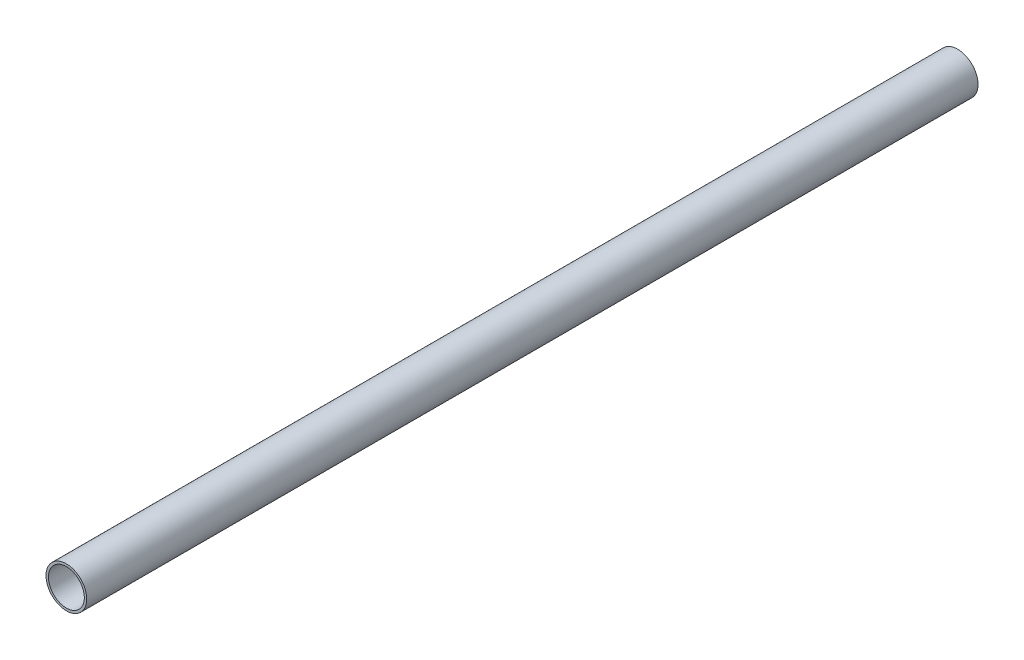
ISO-10303-21;
HEADER;
FILE_DESCRIPTION(('STEP AP214'),'2;1');
FILE_NAME('part.step','',(''),(''),'','','');
FILE_SCHEMA(('AUTOMOTIVE_DESIGN { 1 0 10303 214 1 1 1 1 }'));
ENDSEC;
DATA;
#1=APPLICATION_CONTEXT('core data for automotive mechanical design processes');
#2=APPLICATION_PROTOCOL_DEFINITION('international standard','automotive_design',2000,#1);
#3=PRODUCT_CONTEXT('',#1,'mechanical');
#4=PRODUCT('Part','Part','',(#3));
#5=PRODUCT_RELATED_PRODUCT_CATEGORY('part','',(#4));
#6=PRODUCT_DEFINITION_FORMATION('','',#4);
#7=PRODUCT_DEFINITION_CONTEXT('part definition',#1,'design');
#8=PRODUCT_DEFINITION('design','',#6,#7);
#9=PRODUCT_DEFINITION_SHAPE('','',#8);
#10=(LENGTH_UNIT() NAMED_UNIT(*) SI_UNIT(.MILLI.,.METRE.));
#11=(NAMED_UNIT(*) PLANE_ANGLE_UNIT() SI_UNIT($,.RADIAN.));
#12=(NAMED_UNIT(*) SI_UNIT($,.STERADIAN.) SOLID_ANGLE_UNIT());
#13=UNCERTAINTY_MEASURE_WITH_UNIT(LENGTH_MEASURE(1.E-05),#10,'distance_accuracy_value','');
#14=(GEOMETRIC_REPRESENTATION_CONTEXT(3) GLOBAL_UNCERTAINTY_ASSIGNED_CONTEXT((#13)) GLOBAL_UNIT_ASSIGNED_CONTEXT((#10,
#11,#12)) REPRESENTATION_CONTEXT('',''));
#15=CARTESIAN_POINT('',(0.,0.,0.));
#16=DIRECTION('',(0.,0.,1.));
#17=DIRECTION('',(1.,0.,0.));
#18=AXIS2_PLACEMENT_3D('',#15,#16,#17);
#19=CARTESIAN_POINT('',(0.,0.,372.));
#20=DIRECTION('',(0.,0.,-1.));
#21=DIRECTION('',(-1.,0.,0.));
#22=AXIS2_PLACEMENT_3D('',#19,#20,#21);
#23=CYLINDRICAL_SURFACE('',#22,17.);
#24=CARTESIAN_POINT('',(0.,0.,372.));
#25=DIRECTION('',(0.,0.,1.));
#26=DIRECTION('',(1.,0.,0.));
#27=AXIS2_PLACEMENT_3D('',#24,#25,#26);
#28=CIRCLE('',#27,17.);
#29=CARTESIAN_POINT('',(-17.,0.,372.));
#30=VERTEX_POINT('',#29);
#31=EDGE_CURVE('E10',#30,#30,#28,.T.);
#32=CARTESIAN_POINT('',(0.,0.,-372.));
#33=DIRECTION('',(0.,0.,1.));
#34=DIRECTION('',(1.,0.,0.));
#35=AXIS2_PLACEMENT_3D('',#32,#33,#34);
#36=CIRCLE('',#35,17.);
#37=CARTESIAN_POINT('',(-17.,0.,-372.));
#38=VERTEX_POINT('',#37);
#39=EDGE_CURVE('E33',#38,#38,#36,.T.);
#40=CARTESIAN_POINT('',(-17.,0.,372.));
#41=CARTESIAN_POINT('',(-17.,0.,364.25));
#42=CARTESIAN_POINT('',(-17.,0.,356.5));
#43=CARTESIAN_POINT('',(-17.,0.,341.));
#44=CARTESIAN_POINT('',(-17.,0.,333.25));
#45=CARTESIAN_POINT('',(-17.,0.,317.75));
#46=CARTESIAN_POINT('',(-17.,0.,310.));
#47=CARTESIAN_POINT('',(-17.,0.,294.5));
#48=CARTESIAN_POINT('',(-17.,0.,286.75));
#49=CARTESIAN_POINT('',(-17.,0.,271.25));
#50=CARTESIAN_POINT('',(-17.,0.,263.5));
#51=CARTESIAN_POINT('',(-17.,0.,248.));
#52=CARTESIAN_POINT('',(-17.,0.,240.25));
#53=CARTESIAN_POINT('',(-17.,0.,224.75));
#54=CARTESIAN_POINT('',(-17.,0.,217.));
#55=CARTESIAN_POINT('',(-17.,0.,201.5));
#56=CARTESIAN_POINT('',(-17.,0.,193.75));
#57=CARTESIAN_POINT('',(-17.,0.,178.25));
#58=CARTESIAN_POINT('',(-17.,0.,170.5));
#59=CARTESIAN_POINT('',(-17.,0.,155.));
#60=CARTESIAN_POINT('',(-17.,0.,147.25));
#61=CARTESIAN_POINT('',(-17.,0.,131.75));
#62=CARTESIAN_POINT('',(-17.,0.,124.));
#63=CARTESIAN_POINT('',(-17.,0.,108.5));
#64=CARTESIAN_POINT('',(-17.,0.,100.75));
#65=CARTESIAN_POINT('',(-17.,0.,85.25));
#66=CARTESIAN_POINT('',(-17.,0.,77.5));
#67=CARTESIAN_POINT('',(-17.,0.,62.));
#68=CARTESIAN_POINT('',(-17.,0.,54.25));
#69=CARTESIAN_POINT('',(-17.,0.,38.7499999999999));
#70=CARTESIAN_POINT('',(-17.,0.,30.9999999999999));
#71=CARTESIAN_POINT('',(-17.,0.,15.4999999999999));
#72=CARTESIAN_POINT('',(-17.,0.,7.74999999999994));
#73=CARTESIAN_POINT('',(-17.,0.,-7.75000000000005));
#74=CARTESIAN_POINT('',(-17.,0.,-15.5000000000001));
#75=CARTESIAN_POINT('',(-17.,0.,-31.));
#76=CARTESIAN_POINT('',(-17.,0.,-38.75));
#77=CARTESIAN_POINT('',(-17.,0.,-54.2500000000001));
#78=CARTESIAN_POINT('',(-17.,0.,-62.0000000000001));
#79=CARTESIAN_POINT('',(-17.,0.,-77.5000000000001));
#80=CARTESIAN_POINT('',(-17.,0.,-85.2500000000001));
#81=CARTESIAN_POINT('',(-17.,0.,-100.75));
#82=CARTESIAN_POINT('',(-17.,0.,-108.5));
#83=CARTESIAN_POINT('',(-17.,0.,-124.));
#84=CARTESIAN_POINT('',(-17.,0.,-131.75));
#85=CARTESIAN_POINT('',(-17.,0.,-147.25));
#86=CARTESIAN_POINT('',(-17.,0.,-155.));
#87=CARTESIAN_POINT('',(-17.,0.,-170.5));
#88=CARTESIAN_POINT('',(-17.,0.,-178.25));
#89=CARTESIAN_POINT('',(-17.,0.,-193.75));
#90=CARTESIAN_POINT('',(-17.,0.,-201.5));
#91=CARTESIAN_POINT('',(-17.,0.,-217.));
#92=CARTESIAN_POINT('',(-17.,0.,-224.75));
#93=CARTESIAN_POINT('',(-17.,0.,-240.25));
#94=CARTESIAN_POINT('',(-17.,0.,-248.));
#95=CARTESIAN_POINT('',(-17.,0.,-263.5));
#96=CARTESIAN_POINT('',(-17.,0.,-271.25));
#97=CARTESIAN_POINT('',(-17.,0.,-286.75));
#98=CARTESIAN_POINT('',(-17.,0.,-294.5));
#99=CARTESIAN_POINT('',(-17.,0.,-310.));
#100=CARTESIAN_POINT('',(-17.,0.,-317.75));
#101=CARTESIAN_POINT('',(-17.,0.,-333.25));
#102=CARTESIAN_POINT('',(-17.,0.,-341.));
#103=CARTESIAN_POINT('',(-17.,0.,-356.5));
#104=CARTESIAN_POINT('',(-17.,0.,-364.25));
#105=CARTESIAN_POINT('',(-17.,0.,-372.));
#106=B_SPLINE_CURVE_WITH_KNOTS('',3,(#40,#41,#42,#43,#44,#45,#46,#47,#48,#49,#50,#51,#52,#53,
#54,#55,#56,#57,#58,#59,#60,#61,#62,#63,#64,#65,#66,#67,#68,#69,#70,#71,#72,#73,#74,#75,#76,#77,
#78,#79,#80,#81,#82,#83,#84,#85,#86,#87,#88,#89,#90,#91,#92,#93,#94,#95,#96,#97,#98,#99,#100,
#101,#102,#103,#104,#105),.UNSPECIFIED.,.F.,.F.,(4,2,2,2,2,2,2,2,2,2,2,2,2,2,2,2,2,2,2,2,2,2,2,
2,2,2,2,2,2,2,2,2,4),(0.,23.25,46.5,69.75,93.,116.25,139.5,162.75,186.,209.25,232.5,255.75,279.,
302.25,325.5,348.75,372.,395.25,418.5,441.75,465.,488.25,511.5,534.75,558.,581.25,604.5,627.75,
651.,674.25,697.5,720.75,744.),.UNSPECIFIED.);
#107=EDGE_CURVE('BSEAM30',#30,#38,#106,.T.);
#108=ORIENTED_EDGE('',*,*,#31,.F.);
#109=ORIENTED_EDGE('',*,*,#39,.T.);
#110=ORIENTED_EDGE('',*,*,#107,.T.);
#111=ORIENTED_EDGE('',*,*,#107,.F.);
#112=EDGE_LOOP('',(#108,#110,#109,#111));
#113=FACE_BOUND('',#112,.T.);
#114=ADVANCED_FACE('F30',(#113),#23,.T.);
#115=CARTESIAN_POINT('',(0.,0.,372.));
#116=DIRECTION('',(0.,0.,1.));
#117=DIRECTION('',(1.,0.,0.));
#118=AXIS2_PLACEMENT_3D('',#115,#116,#117);
#119=PLANE('',#118);
#120=CARTESIAN_POINT('',(0.,0.,372.));
#121=DIRECTION('',(0.,0.,1.));
#122=DIRECTION('',(1.,0.,0.));
#123=AXIS2_PLACEMENT_3D('',#120,#121,#122);
#124=CIRCLE('',#123,15.);
#125=CARTESIAN_POINT('',(-15.,0.,372.));
#126=VERTEX_POINT('',#125);
#127=EDGE_CURVE('E40',#126,#126,#124,.T.);
#128=ORIENTED_EDGE('',*,*,#127,.F.);
#129=EDGE_LOOP('',(#128));
#130=FACE_BOUND('',#129,.T.);
#131=ORIENTED_EDGE('',*,*,#31,.T.);
#132=EDGE_LOOP('',(#131));
#133=FACE_BOUND('',#132,.T.);
#134=ADVANCED_FACE('F60',(#130,#133),#119,.T.);
#135=CARTESIAN_POINT('',(0.,0.,-372.));
#136=DIRECTION('',(0.,0.,1.));
#137=DIRECTION('',(1.,0.,0.));
#138=AXIS2_PLACEMENT_3D('',#135,#136,#137);
#139=PLANE('',#138);
#140=ORIENTED_EDGE('',*,*,#39,.F.);
#141=EDGE_LOOP('',(#140));
#142=FACE_BOUND('',#141,.T.);
#143=ADVANCED_FACE('F52',(#142),#139,.F.);
#144=CARTESIAN_POINT('',(0.,0.,372.));
#145=DIRECTION('',(0.,0.,-1.));
#146=DIRECTION('',(-1.,0.,0.));
#147=AXIS2_PLACEMENT_3D('',#144,#145,#146);
#148=CYLINDRICAL_SURFACE('',#147,15.);
#149=CARTESIAN_POINT('',(0.,0.,-370.));
#150=DIRECTION('',(0.,0.,1.));
#151=DIRECTION('',(1.,0.,0.));
#152=AXIS2_PLACEMENT_3D('',#149,#150,#151);
#153=CIRCLE('',#152,15.);
#154=CARTESIAN_POINT('',(-15.,0.,-370.));
#155=VERTEX_POINT('',#154);
#156=EDGE_CURVE('E44',#155,#155,#153,.T.);
#157=CARTESIAN_POINT('',(-15.,0.,372.));
#158=CARTESIAN_POINT('',(-15.,0.,364.270833333333));
#159=CARTESIAN_POINT('',(-15.,0.,356.541666666667));
#160=CARTESIAN_POINT('',(-15.,0.,341.083333333333));
#161=CARTESIAN_POINT('',(-15.,0.,333.354166666667));
#162=CARTESIAN_POINT('',(-15.,0.,317.895833333333));
#163=CARTESIAN_POINT('',(-15.,0.,310.166666666667));
#164=CARTESIAN_POINT('',(-15.,0.,294.708333333333));
#165=CARTESIAN_POINT('',(-15.,0.,286.979166666667));
#166=CARTESIAN_POINT('',(-15.,0.,271.520833333333));
#167=CARTESIAN_POINT('',(-15.,0.,263.791666666667));
#168=CARTESIAN_POINT('',(-15.,0.,248.333333333333));
#169=CARTESIAN_POINT('',(-15.,0.,240.604166666667));
#170=CARTESIAN_POINT('',(-15.,0.,225.145833333333));
#171=CARTESIAN_POINT('',(-15.,0.,217.416666666667));
#172=CARTESIAN_POINT('',(-15.,0.,201.958333333333));
#173=CARTESIAN_POINT('',(-15.,0.,194.229166666667));
#174=CARTESIAN_POINT('',(-15.,0.,178.770833333333));
#175=CARTESIAN_POINT('',(-15.,0.,171.041666666667));
#176=CARTESIAN_POINT('',(-15.,0.,155.583333333333));
#177=CARTESIAN_POINT('',(-15.,0.,147.854166666667));
#178=CARTESIAN_POINT('',(-15.,0.,132.395833333333));
#179=CARTESIAN_POINT('',(-15.,0.,124.666666666667));
#180=CARTESIAN_POINT('',(-15.,0.,109.208333333333));
#181=CARTESIAN_POINT('',(-15.,0.,101.479166666667));
#182=CARTESIAN_POINT('',(-15.,0.,86.0208333333333));
#183=CARTESIAN_POINT('',(-15.,0.,78.2916666666666));
#184=CARTESIAN_POINT('',(-15.,0.,62.8333333333333));
#185=CARTESIAN_POINT('',(-15.,0.,55.1041666666666));
#186=CARTESIAN_POINT('',(-15.,0.,39.6458333333333));
#187=CARTESIAN_POINT('',(-15.,0.,31.9166666666666));
#188=CARTESIAN_POINT('',(-15.,0.,16.4583333333333));
#189=CARTESIAN_POINT('',(-15.,0.,8.72916666666662));
#190=CARTESIAN_POINT('',(-15.,0.,-6.72916666666673));
#191=CARTESIAN_POINT('',(-15.,0.,-14.4583333333334));
#192=CARTESIAN_POINT('',(-15.,0.,-29.9166666666667));
#193=CARTESIAN_POINT('',(-15.,0.,-37.6458333333334));
#194=CARTESIAN_POINT('',(-15.,0.,-53.1041666666667));
#195=CARTESIAN_POINT('',(-15.,0.,-60.8333333333334));
#196=CARTESIAN_POINT('',(-15.,0.,-76.2916666666667));
#197=CARTESIAN_POINT('',(-15.,0.,-84.0208333333334));
#198=CARTESIAN_POINT('',(-15.,0.,-99.4791666666667));
#199=CARTESIAN_POINT('',(-15.,0.,-107.208333333333));
#200=CARTESIAN_POINT('',(-15.,0.,-122.666666666667));
#201=CARTESIAN_POINT('',(-15.,0.,-130.395833333333));
#202=CARTESIAN_POINT('',(-15.,0.,-145.854166666667));
#203=CARTESIAN_POINT('',(-15.,0.,-153.583333333333));
#204=CARTESIAN_POINT('',(-15.,0.,-169.041666666667));
#205=CARTESIAN_POINT('',(-15.,0.,-176.770833333333));
#206=CARTESIAN_POINT('',(-15.,0.,-192.229166666667));
#207=CARTESIAN_POINT('',(-15.,0.,-199.958333333333));
#208=CARTESIAN_POINT('',(-15.,0.,-215.416666666667));
#209=CARTESIAN_POINT('',(-15.,0.,-223.145833333333));
#210=CARTESIAN_POINT('',(-15.,0.,-238.604166666667));
#211=CARTESIAN_POINT('',(-15.,0.,-246.333333333333));
#212=CARTESIAN_POINT('',(-15.,0.,-261.791666666667));
#213=CARTESIAN_POINT('',(-15.,0.,-269.520833333333));
#214=CARTESIAN_POINT('',(-15.,0.,-284.979166666667));
#215=CARTESIAN_POINT('',(-15.,0.,-292.708333333333));
#216=CARTESIAN_POINT('',(-15.,0.,-308.166666666667));
#217=CARTESIAN_POINT('',(-15.,0.,-315.895833333333));
#218=CARTESIAN_POINT('',(-15.,0.,-331.354166666667));
#219=CARTESIAN_POINT('',(-15.,0.,-339.083333333333));
#220=CARTESIAN_POINT('',(-15.,0.,-354.541666666667));
#221=CARTESIAN_POINT('',(-15.,0.,-362.270833333333));
#222=CARTESIAN_POINT('',(-15.,0.,-370.));
#223=B_SPLINE_CURVE_WITH_KNOTS('',3,(#157,#158,#159,#160,#161,#162,#163,#164,#165,#166,#167,
#168,#169,#170,#171,#172,#173,#174,#175,#176,#177,#178,#179,#180,#181,#182,#183,#184,#185,#186,
#187,#188,#189,#190,#191,#192,#193,#194,#195,#196,#197,#198,#199,#200,#201,#202,#203,#204,#205,
#206,#207,#208,#209,#210,#211,#212,#213,#214,#215,#216,#217,#218,#219,#220,#221,#222),
.UNSPECIFIED.,.F.,.F.,(4,2,2,2,2,2,2,2,2,2,2,2,2,2,2,2,2,2,2,2,2,2,2,2,2,2,2,2,2,2,2,2,4),(0.,
23.1875,46.3750000000001,69.5625,92.7500000000001,115.9375,139.125,162.3125,185.5,208.6875,
231.875,255.0625,278.25,301.4375,324.625,347.8125,371.,394.1875,417.375,440.5625,463.75,
486.9375,510.125,533.3125,556.5,579.6875,602.875,626.0625,649.25,672.4375,695.625,718.8125,
742.),.UNSPECIFIED.);
#224=EDGE_CURVE('BSEAM50',#126,#155,#223,.T.);
#225=ORIENTED_EDGE('',*,*,#127,.T.);
#226=ORIENTED_EDGE('',*,*,#156,.F.);
#227=ORIENTED_EDGE('',*,*,#224,.T.);
#228=ORIENTED_EDGE('',*,*,#224,.F.);
#229=EDGE_LOOP('',(#225,#227,#226,#228));
#230=FACE_BOUND('',#229,.T.);
#231=ADVANCED_FACE('F50',(#230),#148,.F.);
#232=CARTESIAN_POINT('',(0.,0.,-370.));
#233=DIRECTION('',(0.,0.,1.));
#234=DIRECTION('',(1.,0.,0.));
#235=AXIS2_PLACEMENT_3D('',#232,#233,#234);
#236=PLANE('',#235);
#237=ORIENTED_EDGE('',*,*,#156,.T.);
#238=EDGE_LOOP('',(#237));
#239=FACE_BOUND('',#238,.T.);
#240=ADVANCED_FACE('F48',(#239),#236,.T.);
#241=CLOSED_SHELL('',(#114,#134,#143,#231,#240));
#242=MANIFOLD_SOLID_BREP('B2',#241);
#243=ADVANCED_BREP_SHAPE_REPRESENTATION('',(#18,#242),#14);
#244=SHAPE_DEFINITION_REPRESENTATION(#9,#243);
ENDSEC;
END-ISO-10303-21;
